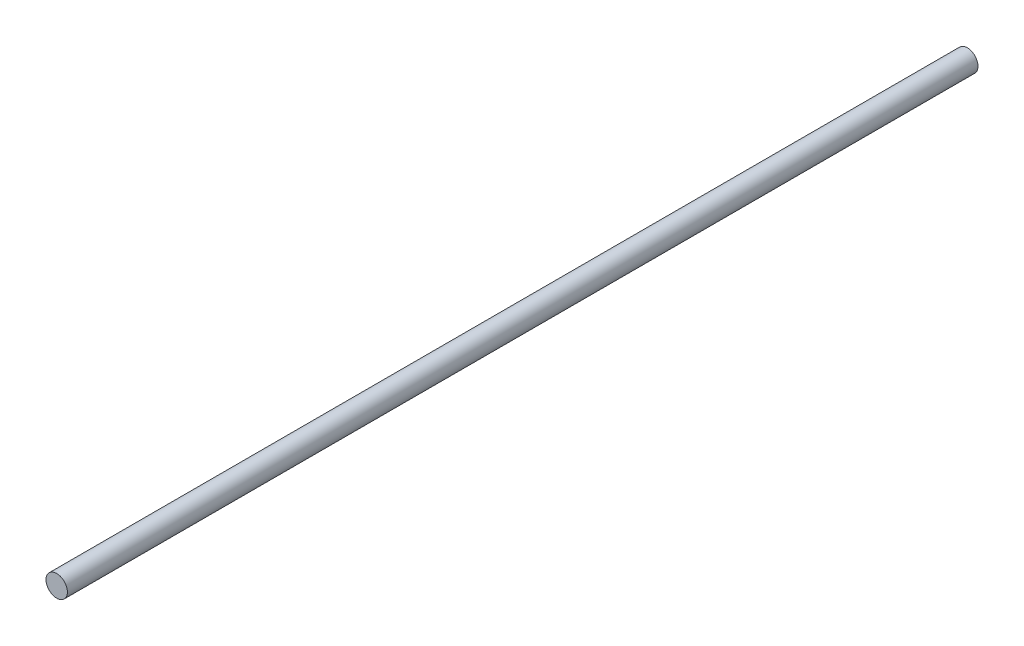
ISO-10303-21;
HEADER;
FILE_DESCRIPTION(('STEP AP214'),'2;1');
FILE_NAME('part.step','',(''),(''),'','','');
FILE_SCHEMA(('AUTOMOTIVE_DESIGN { 1 0 10303 214 1 1 1 1 }'));
ENDSEC;
DATA;
#1=APPLICATION_CONTEXT('core data for automotive mechanical design processes');
#2=APPLICATION_PROTOCOL_DEFINITION('international standard','automotive_design',2000,#1);
#3=PRODUCT_CONTEXT('',#1,'mechanical');
#4=PRODUCT('Part','Part','',(#3));
#5=PRODUCT_RELATED_PRODUCT_CATEGORY('part','',(#4));
#6=PRODUCT_DEFINITION_FORMATION('','',#4);
#7=PRODUCT_DEFINITION_CONTEXT('part definition',#1,'design');
#8=PRODUCT_DEFINITION('design','',#6,#7);
#9=PRODUCT_DEFINITION_SHAPE('','',#8);
#10=(LENGTH_UNIT() NAMED_UNIT(*) SI_UNIT(.MILLI.,.METRE.));
#11=(NAMED_UNIT(*) PLANE_ANGLE_UNIT() SI_UNIT($,.RADIAN.));
#12=(NAMED_UNIT(*) SI_UNIT($,.STERADIAN.) SOLID_ANGLE_UNIT());
#13=UNCERTAINTY_MEASURE_WITH_UNIT(LENGTH_MEASURE(1.E-05),#10,'distance_accuracy_value','');
#14=(GEOMETRIC_REPRESENTATION_CONTEXT(3) GLOBAL_UNCERTAINTY_ASSIGNED_CONTEXT((#13)) GLOBAL_UNIT_ASSIGNED_CONTEXT((#10,
#11,#12)) REPRESENTATION_CONTEXT('',''));
#15=CARTESIAN_POINT('',(0.,0.,0.));
#16=DIRECTION('',(0.,0.,1.));
#17=DIRECTION('',(1.,0.,0.));
#18=AXIS2_PLACEMENT_3D('',#15,#16,#17);
#19=CARTESIAN_POINT('',(0.,0.,212.5));
#20=DIRECTION('',(0.,0.,-1.));
#21=DIRECTION('',(-1.,0.,0.));
#22=AXIS2_PLACEMENT_3D('',#19,#20,#21);
#23=CYLINDRICAL_SURFACE('',#22,5.);
#24=CARTESIAN_POINT('',(0.,0.,212.5));
#25=DIRECTION('',(0.,0.,1.));
#26=DIRECTION('',(1.,0.,0.));
#27=AXIS2_PLACEMENT_3D('',#24,#25,#26);
#28=CIRCLE('',#27,5.);
#29=CARTESIAN_POINT('',(5.,0.,212.5));
#30=VERTEX_POINT('',#29);
#31=EDGE_CURVE('E10',#30,#30,#28,.T.);
#32=ORIENTED_EDGE('',*,*,#31,.F.);
#33=EDGE_LOOP('',(#32));
#34=FACE_BOUND('',#33,.T.);
#35=CARTESIAN_POINT('',(0.,0.,-212.5));
#36=DIRECTION('',(0.,0.,1.));
#37=DIRECTION('',(1.,0.,0.));
#38=AXIS2_PLACEMENT_3D('',#35,#36,#37);
#39=CIRCLE('',#38,5.);
#40=CARTESIAN_POINT('',(5.,0.,-212.5));
#41=VERTEX_POINT('',#40);
#42=EDGE_CURVE('E34',#41,#41,#39,.T.);
#43=ORIENTED_EDGE('',*,*,#42,.T.);
#44=EDGE_LOOP('',(#43));
#45=FACE_BOUND('',#44,.T.);
#46=ADVANCED_FACE('F31',(#34,#45),#23,.T.);
#47=CARTESIAN_POINT('',(0.,0.,212.5));
#48=DIRECTION('',(0.,0.,1.));
#49=DIRECTION('',(1.,0.,0.));
#50=AXIS2_PLACEMENT_3D('',#47,#48,#49);
#51=PLANE('',#50);
#52=ORIENTED_EDGE('',*,*,#31,.T.);
#53=EDGE_LOOP('',(#52));
#54=FACE_BOUND('',#53,.T.);
#55=ADVANCED_FACE('F46',(#54),#51,.T.);
#56=CARTESIAN_POINT('',(0.,0.,-212.5));
#57=DIRECTION('',(0.,0.,1.));
#58=DIRECTION('',(1.,0.,0.));
#59=AXIS2_PLACEMENT_3D('',#56,#57,#58);
#60=PLANE('',#59);
#61=ORIENTED_EDGE('',*,*,#42,.F.);
#62=EDGE_LOOP('',(#61));
#63=FACE_BOUND('',#62,.T.);
#64=ADVANCED_FACE('F44',(#63),#60,.F.);
#65=CLOSED_SHELL('',(#46,#55,#64));
#66=MANIFOLD_SOLID_BREP('B2',#65);
#67=ADVANCED_BREP_SHAPE_REPRESENTATION('',(#18,#66),#14);
#68=SHAPE_DEFINITION_REPRESENTATION(#9,#67);
ENDSEC;
END-ISO-10303-21;
